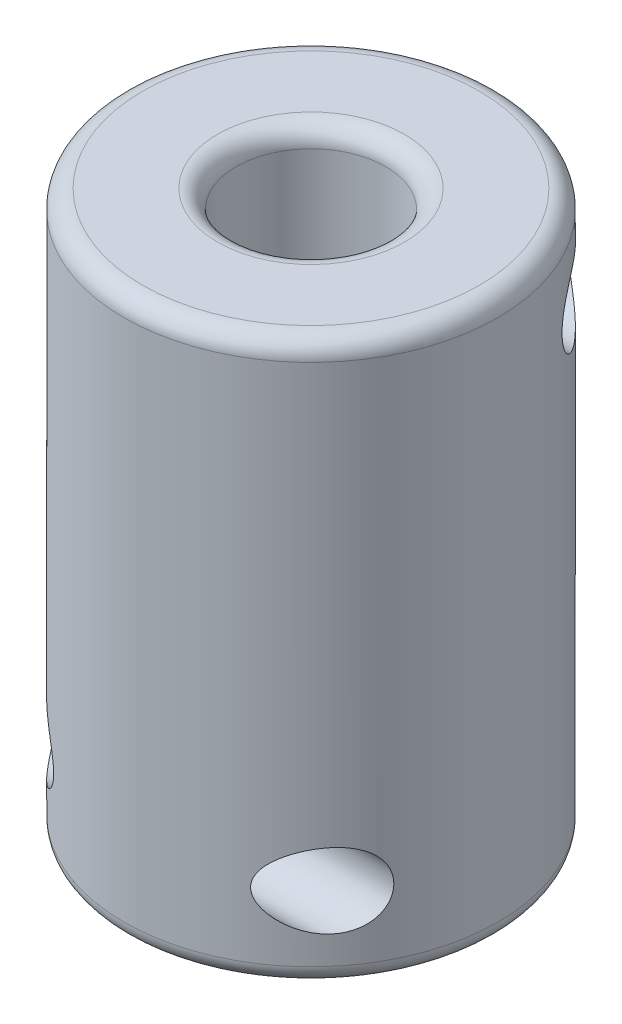
ISO-10303-21;
HEADER;
FILE_DESCRIPTION(('STEP AP214'),'2;1');
FILE_NAME('part.step','',(''),(''),'','','');
FILE_SCHEMA(('AUTOMOTIVE_DESIGN { 1 0 10303 214 1 1 1 1 }'));
ENDSEC;
DATA;
#1=APPLICATION_CONTEXT('core data for automotive mechanical design processes');
#2=APPLICATION_PROTOCOL_DEFINITION('international standard','automotive_design',2000,#1);
#3=PRODUCT_CONTEXT('',#1,'mechanical');
#4=PRODUCT('Part','Part','',(#3));
#5=PRODUCT_RELATED_PRODUCT_CATEGORY('part','',(#4));
#6=PRODUCT_DEFINITION_FORMATION('','',#4);
#7=PRODUCT_DEFINITION_CONTEXT('part definition',#1,'design');
#8=PRODUCT_DEFINITION('design','',#6,#7);
#9=PRODUCT_DEFINITION_SHAPE('','',#8);
#10=(LENGTH_UNIT() NAMED_UNIT(*) SI_UNIT(.MILLI.,.METRE.));
#11=(NAMED_UNIT(*) PLANE_ANGLE_UNIT() SI_UNIT($,.RADIAN.));
#12=(NAMED_UNIT(*) SI_UNIT($,.STERADIAN.) SOLID_ANGLE_UNIT());
#13=UNCERTAINTY_MEASURE_WITH_UNIT(LENGTH_MEASURE(1.E-05),#10,'distance_accuracy_value','');
#14=(GEOMETRIC_REPRESENTATION_CONTEXT(3) GLOBAL_UNCERTAINTY_ASSIGNED_CONTEXT((#13)) GLOBAL_UNIT_ASSIGNED_CONTEXT((#10,
#11,#12)) REPRESENTATION_CONTEXT('',''));
#15=CARTESIAN_POINT('',(0.,0.,0.));
#16=DIRECTION('',(0.,0.,1.));
#17=DIRECTION('',(1.,0.,0.));
#18=AXIS2_PLACEMENT_3D('',#15,#16,#17);
#19=CARTESIAN_POINT('',(0.,30.,0.));
#20=DIRECTION('',(0.,1.,0.));
#21=DIRECTION('',(0.,0.,1.));
#22=AXIS2_PLACEMENT_3D('',#19,#20,#21);
#23=PLANE('',#22);
#24=CARTESIAN_POINT('',(0.,30.,0.));
#25=DIRECTION('',(0.,1.,0.));
#26=DIRECTION('',(0.,0.,1.));
#27=AXIS2_PLACEMENT_3D('',#24,#25,#26);
#28=CIRCLE('',#27,5.);
#29=CARTESIAN_POINT('',(0.,30.,5.));
#30=VERTEX_POINT('',#29);
#31=EDGE_CURVE('E10',#30,#30,#28,.F.);
#32=ORIENTED_EDGE('',*,*,#31,.T.);
#33=EDGE_LOOP('',(#32));
#34=FACE_BOUND('',#33,.T.);
#35=CARTESIAN_POINT('',(0.,30.,0.));
#36=DIRECTION('',(0.,1.,0.));
#37=DIRECTION('',(0.,0.,1.));
#38=AXIS2_PLACEMENT_3D('',#35,#36,#37);
#39=CIRCLE('',#38,9.);
#40=CARTESIAN_POINT('',(0.,30.,9.));
#41=VERTEX_POINT('',#40);
#42=EDGE_CURVE('E44',#41,#41,#39,.T.);
#43=ORIENTED_EDGE('',*,*,#42,.T.);
#44=EDGE_LOOP('',(#43));
#45=FACE_BOUND('',#44,.T.);
#46=ADVANCED_FACE('F37',(#34,#45),#23,.T.);
#47=CARTESIAN_POINT('',(0.,0.,0.));
#48=DIRECTION('',(0.,1.,0.));
#49=DIRECTION('',(0.,0.,1.));
#50=AXIS2_PLACEMENT_3D('',#47,#48,#49);
#51=PLANE('',#50);
#52=CARTESIAN_POINT('',(0.,0.,0.));
#53=DIRECTION('',(0.,1.,0.));
#54=DIRECTION('',(0.,0.,1.));
#55=AXIS2_PLACEMENT_3D('',#52,#53,#54);
#56=CIRCLE('',#55,5.);
#57=CARTESIAN_POINT('',(0.,0.,5.));
#58=VERTEX_POINT('',#57);
#59=EDGE_CURVE('E63',#58,#58,#56,.T.);
#60=ORIENTED_EDGE('',*,*,#59,.T.);
#61=EDGE_LOOP('',(#60));
#62=FACE_BOUND('',#61,.T.);
#63=CARTESIAN_POINT('',(0.,0.,0.));
#64=DIRECTION('',(0.,1.,0.));
#65=DIRECTION('',(0.,0.,1.));
#66=AXIS2_PLACEMENT_3D('',#63,#64,#65);
#67=CIRCLE('',#66,9.);
#68=CARTESIAN_POINT('',(0.,0.,9.));
#69=VERTEX_POINT('',#68);
#70=EDGE_CURVE('E66',#69,#69,#67,.F.);
#71=ORIENTED_EDGE('',*,*,#70,.T.);
#72=EDGE_LOOP('',(#71));
#73=FACE_BOUND('',#72,.T.);
#74=ADVANCED_FACE('F119',(#62,#73),#51,.F.);
#75=CARTESIAN_POINT('',(0.,30.,0.));
#76=DIRECTION('',(0.,-1.,0.));
#77=DIRECTION('',(0.,0.,-1.));
#78=AXIS2_PLACEMENT_3D('',#75,#76,#77);
#79=CYLINDRICAL_SURFACE('',#78,10.);
#80=CARTESIAN_POINT('',(0.,1.,0.));
#81=DIRECTION('',(0.,1.,0.));
#82=DIRECTION('',(0.,0.,1.));
#83=AXIS2_PLACEMENT_3D('',#80,#81,#82);
#84=CIRCLE('',#83,10.);
#85=CARTESIAN_POINT('',(0.,1.,10.));
#86=VERTEX_POINT('',#85);
#87=EDGE_CURVE('E48',#86,#86,#84,.T.);
#88=ORIENTED_EDGE('',*,*,#87,.T.);
#89=EDGE_LOOP('',(#88));
#90=FACE_BOUND('',#89,.T.);
#91=CARTESIAN_POINT('',(0.,29.,0.));
#92=DIRECTION('',(0.,1.,0.));
#93=DIRECTION('',(0.,0.,1.));
#94=AXIS2_PLACEMENT_3D('',#91,#92,#93);
#95=CIRCLE('',#94,10.);
#96=CARTESIAN_POINT('',(0.,29.,10.));
#97=VERTEX_POINT('',#96);
#98=EDGE_CURVE('E52',#97,#97,#95,.F.);
#99=ORIENTED_EDGE('',*,*,#98,.T.);
#100=EDGE_LOOP('',(#99));
#101=FACE_BOUND('',#100,.T.);
#102=CARTESIAN_POINT('',(-5.26782687642637,25.5,-8.5));
#103=CARTESIAN_POINT('',(-5.26783468933703,25.5641810144466,-8.49999585800703));
#104=CARTESIAN_POINT('',(-5.27287446632023,25.6284018901688,-8.49687808090354));
#105=CARTESIAN_POINT('',(-5.29241116775197,25.7548229722007,-8.48472194501432));
#106=CARTESIAN_POINT('',(-5.30692237379403,25.8170199778692,-8.47567464525058));
#107=CARTESIAN_POINT('',(-5.34877974231708,25.9540486137529,-8.44933764641172));
#108=CARTESIAN_POINT('',(-5.37851325511278,26.0278402155853,-8.43049561530521));
#109=CARTESIAN_POINT('',(-5.44717856580428,26.1688723060571,-8.38629351416825));
#110=CARTESIAN_POINT('',(-5.48613060979344,26.2360979084608,-8.36091908651258));
#111=CARTESIAN_POINT('',(-5.59565474938343,26.4026008048988,-8.2882521680363));
#112=CARTESIAN_POINT('',(-5.67115545397736,26.4968414981962,-8.23695530960263));
#113=CARTESIAN_POINT('',(-5.83090508601502,26.6709943185028,-8.12466452975615));
#114=CARTESIAN_POINT('',(-5.91517636445182,26.7508683484064,-8.06364561182168));
#115=CARTESIAN_POINT('',(-6.06993090860967,26.8822431285574,-7.94752932180928));
#116=CARTESIAN_POINT('',(-6.13952500792072,26.9361628889242,-7.89394148714846));
#117=CARTESIAN_POINT('',(-6.28045077932381,27.0366792751538,-7.78228897329592));
#118=CARTESIAN_POINT('',(-6.35178334114708,27.0832720561948,-7.72422196732808));
#119=CARTESIAN_POINT('',(-6.49531393900922,27.1693778463069,-7.60392506638708));
#120=CARTESIAN_POINT('',(-6.56751264158712,27.208884972578,-7.54169177071286));
#121=CARTESIAN_POINT('',(-6.71202828732485,27.280777462762,-7.41336733040518));
#122=CARTESIAN_POINT('',(-6.78434523258653,27.3131626986606,-7.34727611645364));
#123=CARTESIAN_POINT('',(-6.93013465473774,27.3712676016843,-7.20995735537162));
#124=CARTESIAN_POINT('',(-7.00359639591283,27.3968204166321,-7.13864757142014));
#125=CARTESIAN_POINT('',(-7.14945658663805,27.4398922804075,-6.9925622590824));
#126=CARTESIAN_POINT('',(-7.22185486995423,27.4574100859137,-6.91778619630077));
#127=CARTESIAN_POINT('',(-7.36488245400177,27.4838309586506,-6.76530900556368));
#128=CARTESIAN_POINT('',(-7.43551463905561,27.4927491063008,-6.68761324718972));
#129=CARTESIAN_POINT('',(-7.57450422890797,27.5013393572645,-6.52977430005425));
#130=CARTESIAN_POINT('',(-7.6428625681056,27.5010153066976,-6.44963214322526));
#131=CARTESIAN_POINT('',(-7.80577298479456,27.4880265391663,-6.25240275225441));
#132=CARTESIAN_POINT('',(-7.89883476339544,27.4700733198581,-6.13435956549366));
#133=CARTESIAN_POINT('',(-8.07686513309303,27.4111144767495,-5.89797241753845));
#134=CARTESIAN_POINT('',(-8.1618442260271,27.3701392574216,-5.77962905756117));
#135=CARTESIAN_POINT('',(-8.30818802006161,27.2720768516786,-5.56667309385873));
#136=CARTESIAN_POINT('',(-8.3711278593854,27.2188135940561,-5.47139289105609));
#137=CARTESIAN_POINT('',(-8.48852288877,27.0943579580769,-5.28742566198973));
#138=CARTESIAN_POINT('',(-8.54298000161333,27.0231696523972,-5.19873714397661));
#139=CARTESIAN_POINT('',(-8.64249124894106,26.8628152312219,-5.03158927374364));
#140=CARTESIAN_POINT('',(-8.68747978644655,26.77353160396,-4.95320260994332));
#141=CARTESIAN_POINT('',(-8.76653895619213,26.5792197951433,-4.81190003614039));
#142=CARTESIAN_POINT('',(-8.80061627516256,26.4742013145459,-4.74897465650912));
#143=CARTESIAN_POINT('',(-8.85372236687568,26.2655036757026,-4.6491302811934));
#144=CARTESIAN_POINT('',(-8.87408136340246,26.1632296651462,-4.60997270289893));
#145=CARTESIAN_POINT('',(-8.90562480807577,25.9523529397072,-4.54874164366921));
#146=CARTESIAN_POINT('',(-8.91681392734973,25.8437534772402,-4.52665946486451));
#147=CARTESIAN_POINT('',(-8.9294150394175,25.6321753106102,-4.50174647314831));
#148=CARTESIAN_POINT('',(-8.93150063825177,25.5293902366901,-4.49758960341635));
#149=CARTESIAN_POINT('',(-8.92772613995887,25.3245568048789,-4.50507771888106));
#150=CARTESIAN_POINT('',(-8.92186771586574,25.222508296415,-4.51671937686283));
#151=CARTESIAN_POINT('',(-8.90244223664521,25.0240342779298,-4.55488330792238));
#152=CARTESIAN_POINT('',(-8.88902317418737,24.9275389000015,-4.58111977921979));
#153=CARTESIAN_POINT('',(-8.85471376785878,24.7407045569377,-4.6470869456755));
#154=CARTESIAN_POINT('',(-8.83382325725241,24.6503657292478,-4.68681794198162));
#155=CARTESIAN_POINT('',(-8.78421833092708,24.4759624441933,-4.77915329612052));
#156=CARTESIAN_POINT('',(-8.75532959100645,24.3920984086052,-4.83204145188658));
#157=CARTESIAN_POINT('',(-8.69035848562896,24.2348323507535,-4.94793643896143));
#158=CARTESIAN_POINT('',(-8.65427451463974,24.1614326697696,-5.01094552802778));
#159=CARTESIAN_POINT('',(-8.57268661322164,24.0214433399385,-5.14936142321092));
#160=CARTESIAN_POINT('',(-8.52669998802749,23.9556904785029,-5.22532741425819));
#161=CARTESIAN_POINT('',(-8.42792094588793,23.8379325519282,-5.38319882641644));
#162=CARTESIAN_POINT('',(-8.37512621162925,23.7859321862727,-5.46510626567847));
#163=CARTESIAN_POINT('',(-8.25656515294015,23.6898138395964,-5.64286368641929));
#164=CARTESIAN_POINT('',(-8.19000272653328,23.6475234283882,-5.73916723545717));
#165=CARTESIAN_POINT('',(-8.05067224057732,23.5792852616135,-5.93304235441428));
#166=CARTESIAN_POINT('',(-7.9778991235997,23.5533509719819,-6.03061490182587));
#167=CARTESIAN_POINT('',(-7.79273251095244,23.5081116864283,-6.26939630113612));
#168=CARTESIAN_POINT('',(-7.67750397904637,23.4973344256426,-6.41004577287917));
#169=CARTESIAN_POINT('',(-7.43985242696654,23.503781633376,-6.68443916519708));
#170=CARTESIAN_POINT('',(-7.31741865255885,23.5210490369932,-6.81817217344082));
#171=CARTESIAN_POINT('',(-7.06671259124475,23.580577050101,-7.07775439645018));
#172=CARTESIAN_POINT('',(-6.93838204166168,23.6231895315093,-7.20346448074513));
#173=CARTESIAN_POINT('',(-6.68044568802202,23.7315139312166,-7.4432939062457));
#174=CARTESIAN_POINT('',(-6.55083927269147,23.7972375038227,-7.55740736208781));
#175=CARTESIAN_POINT('',(-6.36347883433235,23.9097462582046,-7.71441049361888));
#176=CARTESIAN_POINT('',(-6.3046434650718,23.9476499680435,-7.76254223330248));
#177=CARTESIAN_POINT('',(-6.1880290252326,24.0284127341426,-7.85581664537213));
#178=CARTESIAN_POINT('',(-6.13024954078748,24.0712697984418,-7.90096050790793));
#179=CARTESIAN_POINT('',(-6.01645344389805,24.1621126744182,-7.98795407462859));
#180=CARTESIAN_POINT('',(-5.9604341469093,24.2100901307783,-8.02980895758489));
#181=CARTESIAN_POINT('',(-5.85095670080282,24.3115910719135,-8.10992605430749));
#182=CARTESIAN_POINT('',(-5.79749686351125,24.3651108252883,-8.14819065260638));
#183=CARTESIAN_POINT('',(-5.69013439778527,24.4828434624383,-8.22356407639358));
#184=CARTESIAN_POINT('',(-5.63654712188264,24.5475714618167,-8.26032781088111));
#185=CARTESIAN_POINT('',(-5.53609981701022,24.6849314015301,-8.32798013172293));
#186=CARTESIAN_POINT('',(-5.48923359071316,24.7575559505502,-8.35887413907183));
#187=CARTESIAN_POINT('',(-5.41446144564242,24.8951835866438,-8.40744734385509));
#188=CARTESIAN_POINT('',(-5.38463943993381,24.9586283750081,-8.42653864791776));
#189=CARTESIAN_POINT('',(-5.33386960184705,25.0903741222918,-8.45876750482235));
#190=CARTESIAN_POINT('',(-5.31289940473602,25.1586623272838,-8.47192006825766));
#191=CARTESIAN_POINT('',(-5.28784078417205,25.2729250329884,-8.48757147169723));
#192=CARTESIAN_POINT('',(-5.28038061026528,25.3178798224046,-8.49220912164965));
#193=CARTESIAN_POINT('',(-5.27037095442739,25.4085496776573,-8.49842481064375));
#194=CARTESIAN_POINT('',(-5.26782130895951,25.4542647181237,-8.50000295157715));
#195=CARTESIAN_POINT('',(-5.26782687642637,25.5,-8.5));
#196=B_SPLINE_CURVE_WITH_KNOTS('',3,(#102,#103,#104,#105,#106,#107,#108,#109,#110,#111,#112,
#113,#114,#115,#116,#117,#118,#119,#120,#121,#122,#123,#124,#125,#126,#127,#128,#129,#130,#131,
#132,#133,#134,#135,#136,#137,#138,#139,#140,#141,#142,#143,#144,#145,#146,#147,#148,#149,#150,
#151,#152,#153,#154,#155,#156,#157,#158,#159,#160,#161,#162,#163,#164,#165,#166,#167,#168,#169,
#170,#171,#172,#173,#174,#175,#176,#177,#178,#179,#180,#181,#182,#183,#184,#185,#186,#187,#188,
#189,#190,#191,#192,#193,#194,#195),.UNSPECIFIED.,.T.,.F.,(4,2,2,2,2,2,2,2,2,2,2,2,2,2,2,2,2,2,
2,2,2,2,2,2,2,2,2,2,2,2,2,2,2,2,2,2,2,2,2,2,2,2,2,2,2,2,4),(0.,0.192356136850875,
0.385002992074888,0.628894166773206,0.873326038472196,1.2647502249882,1.6571975490887,
1.96600552620744,2.27497501298995,2.58419984322563,2.89343023124566,3.20963664233791,
3.52589196609085,3.84159168830622,4.15716003472642,4.60951992656819,5.06128379966637,
5.43774761785874,5.81412597830308,6.19303173582779,6.57170484183424,6.90409493143276,
7.2363155963824,7.54348589355933,7.8505915098358,8.15188481929897,8.4531848529548,
8.76165355457469,9.07019116458734,9.40033411224758,9.73058973054751,10.1025963905346,
10.4749089237944,11.0183699690919,11.5626638129415,12.1146966298919,12.6670082224276,
12.9216750850292,13.176239888935,13.4303954745694,13.6843810466807,13.9589539285194,
14.2332719822563,14.4505132535807,14.6672023153504,14.8042795369341,14.9413521933162),.UNSPECIFIED.);
#197=CARTESIAN_POINT('',(-5.26782687642637,25.5,-8.5));
#198=VERTEX_POINT('',#197);
#199=EDGE_CURVE('E69',#198,#198,#196,.T.);
#200=ORIENTED_EDGE('',*,*,#199,.T.);
#201=EDGE_LOOP('',(#200));
#202=FACE_BOUND('',#201,.T.);
#203=CARTESIAN_POINT('',(5.26782687642637,25.5,-8.5));
#204=CARTESIAN_POINT('',(5.26783468933703,25.4358189855534,-8.49999585800703));
#205=CARTESIAN_POINT('',(5.27287446632023,25.3715981098312,-8.49687808090354));
#206=CARTESIAN_POINT('',(5.29241116775197,25.2451770277993,-8.48472194501432));
#207=CARTESIAN_POINT('',(5.30692237379403,25.1829800221308,-8.47567464525058));
#208=CARTESIAN_POINT('',(5.34877974231708,25.0459513862471,-8.44933764641172));
#209=CARTESIAN_POINT('',(5.37851325511278,24.9721597844147,-8.4304956153052));
#210=CARTESIAN_POINT('',(5.44717856580428,24.8311276939429,-8.38629351416825));
#211=CARTESIAN_POINT('',(5.48613060979344,24.7639020915392,-8.36091908651258));
#212=CARTESIAN_POINT('',(5.59565474938343,24.5973991951012,-8.2882521680363));
#213=CARTESIAN_POINT('',(5.67115545397735,24.5031585018038,-8.23695530960263));
#214=CARTESIAN_POINT('',(5.83090508601502,24.3290056814972,-8.12466452975615));
#215=CARTESIAN_POINT('',(5.91517636445182,24.2491316515936,-8.06364561182168));
#216=CARTESIAN_POINT('',(6.06993090860967,24.1177568714426,-7.94752932180928));
#217=CARTESIAN_POINT('',(6.13952500792072,24.0638371110758,-7.89394148714846));
#218=CARTESIAN_POINT('',(6.28045077932381,23.9633207248462,-7.78228897329592));
#219=CARTESIAN_POINT('',(6.35178334114708,23.9167279438052,-7.72422196732808));
#220=CARTESIAN_POINT('',(6.49531393900922,23.8306221536931,-7.60392506638708));
#221=CARTESIAN_POINT('',(6.56751264158712,23.791115027422,-7.54169177071286));
#222=CARTESIAN_POINT('',(6.71202828732485,23.719222537238,-7.41336733040518));
#223=CARTESIAN_POINT('',(6.78434523258653,23.6868373013394,-7.34727611645364));
#224=CARTESIAN_POINT('',(6.93013465473774,23.6287323983157,-7.20995735537162));
#225=CARTESIAN_POINT('',(7.00359639591283,23.6031795833679,-7.13864757142014));
#226=CARTESIAN_POINT('',(7.14945658663805,23.5601077195924,-6.9925622590824));
#227=CARTESIAN_POINT('',(7.22185486995423,23.5425899140863,-6.91778619630077));
#228=CARTESIAN_POINT('',(7.36488245400177,23.5161690413494,-6.76530900556368));
#229=CARTESIAN_POINT('',(7.43551463905561,23.5072508936992,-6.68761324718972));
#230=CARTESIAN_POINT('',(7.57450422890797,23.4986606427355,-6.52977430005425));
#231=CARTESIAN_POINT('',(7.6428625681056,23.4989846933024,-6.44963214322526));
#232=CARTESIAN_POINT('',(7.80577298479456,23.5119734608337,-6.25240275225441));
#233=CARTESIAN_POINT('',(7.89883476339544,23.5299266801419,-6.13435956549367));
#234=CARTESIAN_POINT('',(8.07686513309303,23.5888855232505,-5.89797241753845));
#235=CARTESIAN_POINT('',(8.1618442260271,23.6298607425784,-5.77962905756117));
#236=CARTESIAN_POINT('',(8.30818802006161,23.7279231483214,-5.56667309385873));
#237=CARTESIAN_POINT('',(8.3711278593854,23.7811864059439,-5.47139289105609));
#238=CARTESIAN_POINT('',(8.48852288877,23.9056420419231,-5.28742566198973));
#239=CARTESIAN_POINT('',(8.54298000161333,23.9768303476028,-5.19873714397661));
#240=CARTESIAN_POINT('',(8.64249124894106,24.1371847687781,-5.03158927374364));
#241=CARTESIAN_POINT('',(8.68747978644655,24.22646839604,-4.95320260994332));
#242=CARTESIAN_POINT('',(8.76653895619213,24.4207802048567,-4.81190003614039));
#243=CARTESIAN_POINT('',(8.80061627516256,24.5257986854541,-4.74897465650912));
#244=CARTESIAN_POINT('',(8.85372236687568,24.7344963242974,-4.6491302811934));
#245=CARTESIAN_POINT('',(8.87408136340246,24.8367703348538,-4.60997270289893));
#246=CARTESIAN_POINT('',(8.90562480807577,25.0476470602928,-4.54874164366921));
#247=CARTESIAN_POINT('',(8.91681392734973,25.1562465227598,-4.52665946486451));
#248=CARTESIAN_POINT('',(8.9294150394175,25.3678246893898,-4.50174647314831));
#249=CARTESIAN_POINT('',(8.93150063825177,25.4706097633099,-4.49758960341635));
#250=CARTESIAN_POINT('',(8.92772613995887,25.6754431951211,-4.50507771888106));
#251=CARTESIAN_POINT('',(8.92186771586574,25.777491703585,-4.51671937686283));
#252=CARTESIAN_POINT('',(8.90244223664521,25.9759657220702,-4.55488330792238));
#253=CARTESIAN_POINT('',(8.88902317418737,26.0724610999985,-4.58111977921979));
#254=CARTESIAN_POINT('',(8.85471376785878,26.2592954430623,-4.6470869456755));
#255=CARTESIAN_POINT('',(8.83382325725241,26.3496342707522,-4.68681794198162));
#256=CARTESIAN_POINT('',(8.78421833092708,26.5240375558067,-4.77915329612052));
#257=CARTESIAN_POINT('',(8.75532959100645,26.6079015913948,-4.83204145188658));
#258=CARTESIAN_POINT('',(8.69035848562896,26.7651676492465,-4.94793643896143));
#259=CARTESIAN_POINT('',(8.65427451463974,26.8385673302304,-5.01094552802778));
#260=CARTESIAN_POINT('',(8.57268661322164,26.9785566600615,-5.14936142321092));
#261=CARTESIAN_POINT('',(8.52669998802749,27.0443095214971,-5.22532741425819));
#262=CARTESIAN_POINT('',(8.42792094588793,27.1620674480718,-5.38319882641644));
#263=CARTESIAN_POINT('',(8.37512621162925,27.2140678137273,-5.46510626567847));
#264=CARTESIAN_POINT('',(8.25656515294015,27.3101861604036,-5.64286368641929));
#265=CARTESIAN_POINT('',(8.19000272653328,27.3524765716118,-5.73916723545717));
#266=CARTESIAN_POINT('',(8.05067224057732,27.4207147383865,-5.93304235441428));
#267=CARTESIAN_POINT('',(7.9778991235997,27.4466490280181,-6.03061490182587));
#268=CARTESIAN_POINT('',(7.79273251095244,27.4918883135717,-6.26939630113612));
#269=CARTESIAN_POINT('',(7.67750397904637,27.5026655743574,-6.41004577287917));
#270=CARTESIAN_POINT('',(7.43985242696654,27.496218366624,-6.68443916519708));
#271=CARTESIAN_POINT('',(7.31741865255885,27.4789509630068,-6.81817217344082));
#272=CARTESIAN_POINT('',(7.06671259124475,27.419422949899,-7.07775439645018));
#273=CARTESIAN_POINT('',(6.93838204166168,27.3768104684907,-7.20346448074513));
#274=CARTESIAN_POINT('',(6.68044568802202,27.2684860687834,-7.4432939062457));
#275=CARTESIAN_POINT('',(6.55083927269147,27.2027624961773,-7.55740736208781));
#276=CARTESIAN_POINT('',(6.36347883433235,27.0902537417954,-7.71441049361888));
#277=CARTESIAN_POINT('',(6.3046434650718,27.0523500319565,-7.76254223330248));
#278=CARTESIAN_POINT('',(6.1880290252326,26.9715872658574,-7.85581664537213));
#279=CARTESIAN_POINT('',(6.13024954078748,26.9287302015582,-7.90096050790793));
#280=CARTESIAN_POINT('',(6.01645344389805,26.8378873255818,-7.98795407462859));
#281=CARTESIAN_POINT('',(5.9604341469093,26.7899098692217,-8.02980895758489));
#282=CARTESIAN_POINT('',(5.85095670080282,26.6884089280865,-8.10992605430749));
#283=CARTESIAN_POINT('',(5.79749686351125,26.6348891747117,-8.14819065260638));
#284=CARTESIAN_POINT('',(5.69013439778527,26.5171565375617,-8.22356407639358));
#285=CARTESIAN_POINT('',(5.63654712188264,26.4524285381833,-8.26032781088111));
#286=CARTESIAN_POINT('',(5.53609981701022,26.3150685984699,-8.32798013172294));
#287=CARTESIAN_POINT('',(5.48923359071316,26.2424440494498,-8.35887413907183));
#288=CARTESIAN_POINT('',(5.41446144564242,26.1048164133562,-8.40744734385509));
#289=CARTESIAN_POINT('',(5.38463943993381,26.0413716249919,-8.42653864791776));
#290=CARTESIAN_POINT('',(5.33386960184705,25.9096258777082,-8.45876750482235));
#291=CARTESIAN_POINT('',(5.31289940473602,25.8413376727162,-8.47192006825766));
#292=CARTESIAN_POINT('',(5.28784078417205,25.7270749670116,-8.48757147169723));
#293=CARTESIAN_POINT('',(5.28038061026528,25.6821201775954,-8.49220912164965));
#294=CARTESIAN_POINT('',(5.27037095442739,25.5914503223427,-8.49842481064375));
#295=CARTESIAN_POINT('',(5.26782130895951,25.5457352818763,-8.50000295157715));
#296=CARTESIAN_POINT('',(5.26782687642637,25.5,-8.5));
#297=B_SPLINE_CURVE_WITH_KNOTS('',3,(#203,#204,#205,#206,#207,#208,#209,#210,#211,#212,#213,
#214,#215,#216,#217,#218,#219,#220,#221,#222,#223,#224,#225,#226,#227,#228,#229,#230,#231,#232,
#233,#234,#235,#236,#237,#238,#239,#240,#241,#242,#243,#244,#245,#246,#247,#248,#249,#250,#251,
#252,#253,#254,#255,#256,#257,#258,#259,#260,#261,#262,#263,#264,#265,#266,#267,#268,#269,#270,
#271,#272,#273,#274,#275,#276,#277,#278,#279,#280,#281,#282,#283,#284,#285,#286,#287,#288,#289,
#290,#291,#292,#293,#294,#295,#296),.UNSPECIFIED.,.T.,.F.,(4,2,2,2,2,2,2,2,2,2,2,2,2,2,2,2,2,2,
2,2,2,2,2,2,2,2,2,2,2,2,2,2,2,2,2,2,2,2,2,2,2,2,2,2,2,2,4),(0.,0.192356136850875,
0.385002992074888,0.628894166773214,0.873326038472196,1.2647502249882,1.6571975490887,
1.96600552620744,2.27497501298995,2.58419984322563,2.89343023124567,3.20963664233791,
3.52589196609085,3.84159168830622,4.15716003472643,4.60951992656819,5.06128379966637,
5.43774761785874,5.81412597830308,6.19303173582779,6.57170484183424,6.90409493143276,
7.2363155963824,7.54348589355933,7.8505915098358,8.15188481929897,8.4531848529548,
8.76165355457469,9.07019116458734,9.40033411224758,9.73058973054751,10.1025963905346,
10.4749089237944,11.0183699690919,11.5626638129415,12.1146966298919,12.6670082224276,
12.9216750850292,13.176239888935,13.4303954745694,13.6843810466807,13.9589539285194,
14.2332719822563,14.4505132535808,14.6672023153504,14.8042795369341,14.9413521933162),.UNSPECIFIED.);
#298=CARTESIAN_POINT('',(5.26782687642637,25.5,-8.5));
#299=VERTEX_POINT('',#298);
#300=EDGE_CURVE('E77',#299,#299,#297,.T.);
#301=ORIENTED_EDGE('',*,*,#300,.T.);
#302=EDGE_LOOP('',(#301));
#303=FACE_BOUND('',#302,.T.);
#304=CARTESIAN_POINT('',(-8.93028554974588,4.5,4.5));
#305=CARTESIAN_POINT('',(-8.93028695994491,4.60251908318556,4.49999424650266));
#306=CARTESIAN_POINT('',(-8.9263126480724,4.70500244851639,4.50790957581226));
#307=CARTESIAN_POINT('',(-8.91045495734808,4.90692224123514,4.53917400928241));
#308=CARTESIAN_POINT('',(-8.89857493789984,5.00635994406268,4.56251655786487));
#309=CARTESIAN_POINT('',(-8.86703729509127,5.19928547846273,4.62350663067364));
#310=CARTESIAN_POINT('',(-8.84738898578792,5.29278028022131,4.66113702186731));
#311=CARTESIAN_POINT('',(-8.80053397958957,5.47157109812932,4.74900724079461));
#312=CARTESIAN_POINT('',(-8.77332630609691,5.55686605301915,4.79924869767643));
#313=CARTESIAN_POINT('',(-8.71086367461473,5.71961030171675,4.91172977553368));
#314=CARTESIAN_POINT('',(-8.67540879948888,5.79678087860329,4.97426021255354));
#315=CARTESIAN_POINT('',(-8.59744484378922,5.93923773233773,5.10782920507559));
#316=CARTESIAN_POINT('',(-8.55493395222354,6.00452094914079,5.17886994351944));
#317=CARTESIAN_POINT('',(-8.45932683832755,6.12804536424431,5.33374106336925));
#318=CARTESIAN_POINT('',(-8.40561652619928,6.18508578408844,5.41814679783292));
#319=CARTESIAN_POINT('',(-8.29160021843436,6.28432339771251,5.59107447354278));
#320=CARTESIAN_POINT('',(-8.2312913436627,6.32651407801202,5.67959820182174));
#321=CARTESIAN_POINT('',(-8.09558483180366,6.40196863761346,5.87173838542017));
#322=CARTESIAN_POINT('',(-8.01928327256835,6.43292690667104,5.975617734749));
#323=CARTESIAN_POINT('',(-7.86082768374191,6.4774937896971,6.18259250029893));
#324=CARTESIAN_POINT('',(-7.77866925504798,6.4910892143082,6.2856872615022));
#325=CARTESIAN_POINT('',(-7.56918742967299,6.50532522718103,6.5380116497424));
#326=CARTESIAN_POINT('',(-7.43916534433482,6.4965757238822,6.68555279133046));
#327=CARTESIAN_POINT('',(-7.17305384603504,6.44928566285169,6.97032692945614));
#328=CARTESIAN_POINT('',(-7.03695159373923,6.41067895428584,7.1075362934657));
#329=CARTESIAN_POINT('',(-6.83038800415784,6.3324627087157,7.30445550541691));
#330=CARTESIAN_POINT('',(-6.76063754100397,6.3027265159099,7.36903048209584));
#331=CARTESIAN_POINT('',(-6.62111815610134,6.23658741231943,7.49463711626133));
#332=CARTESIAN_POINT('',(-6.55134924656561,6.20018654800023,7.55566985387817));
#333=CARTESIAN_POINT('',(-6.41245823287937,6.12081228428604,7.673896641618));
#334=CARTESIAN_POINT('',(-6.34333549341237,6.07784627026805,7.73109490253611));
#335=CARTESIAN_POINT('',(-6.2064256735377,5.98517866816432,7.84142880614206));
#336=CARTESIAN_POINT('',(-6.13863801073122,5.93548009505464,7.89456625077962));
#337=CARTESIAN_POINT('',(-5.99044782520503,5.81706049188389,8.00781157817205));
#338=CARTESIAN_POINT('',(-5.9106072356108,5.74656963592954,8.06682756671953));
#339=CARTESIAN_POINT('',(-5.75707421700095,5.59371423156617,8.17710082583848));
#340=CARTESIAN_POINT('',(-5.68337518143883,5.51136270905108,8.22836648318081));
#341=CARTESIAN_POINT('',(-5.5660589303607,5.35814529147661,8.30797985110127));
#342=CARTESIAN_POINT('',(-5.51981135574558,5.29056455726921,8.33871780957168));
#343=CARTESIAN_POINT('',(-5.43582584410533,5.14784116419552,8.39370621140374));
#344=CARTESIAN_POINT('',(-5.39807174142544,5.07271327113663,8.41796899567609));
#345=CARTESIAN_POINT('',(-5.34311346383607,4.9355677422052,8.45292382139561));
#346=CARTESIAN_POINT('',(-5.32312055742142,4.87516642054125,8.46550200225049));
#347=CARTESIAN_POINT('',(-5.29176904143191,4.75130122408331,8.4851357092215));
#348=CARTESIAN_POINT('',(-5.28039906516154,4.68784149870194,8.49219850605027));
#349=CARTESIAN_POINT('',(-5.26755899307402,4.55913081516998,8.50016980698475));
#350=CARTESIAN_POINT('',(-5.26614727305669,4.49387154249448,8.50104202177033));
#351=CARTESIAN_POINT('',(-5.27357202176654,4.36415730080561,8.49643770856285));
#352=CARTESIAN_POINT('',(-5.28241326588697,4.29970272072114,8.49095822221891));
#353=CARTESIAN_POINT('',(-5.3082279457571,4.17831797431762,8.4748403695264));
#354=CARTESIAN_POINT('',(-5.3245425462651,4.12118585059345,8.4646192283882));
#355=CARTESIAN_POINT('',(-5.36360016642667,4.01017341204862,8.43992469792515));
#356=CARTESIAN_POINT('',(-5.38634556607098,3.95629431012291,8.425449734214));
#357=CARTESIAN_POINT('',(-5.45496177353184,3.81477441375584,8.38128970089334));
#358=CARTESIAN_POINT('',(-5.50572557210055,3.73060114112558,8.34813734716695));
#359=CARTESIAN_POINT('',(-5.61652223422507,3.57231672280687,8.27400463066948));
#360=CARTESIAN_POINT('',(-5.67658848325122,3.49824370095628,8.2329959415245));
#361=CARTESIAN_POINT('',(-5.79203691020225,3.37069189715088,8.1520821637093));
#362=CARTESIAN_POINT('',(-5.84656552889984,3.31582946742105,8.1131041545233));
#363=CARTESIAN_POINT('',(-5.95831558573092,3.21189649447776,8.0313927988758));
#364=CARTESIAN_POINT('',(-6.01553879368122,3.16282983430597,7.98865696782099));
#365=CARTESIAN_POINT('',(-6.13174938984073,3.07008555079069,7.89981022658346));
#366=CARTESIAN_POINT('',(-6.1907376345083,3.02641059815966,7.8536976616528));
#367=CARTESIAN_POINT('',(-6.30980026064209,2.94421323093491,7.75836665877951));
#368=CARTESIAN_POINT('',(-6.36987507096831,2.90569290353922,7.70914697451076));
#369=CARTESIAN_POINT('',(-6.55826958909585,2.79327388436341,7.5509574525888));
#370=CARTESIAN_POINT('',(-6.68761787161234,2.7281080614511,7.4368450666677));
#371=CARTESIAN_POINT('',(-6.9449869446905,2.62083006045075,7.19709103696667));
#372=CARTESIAN_POINT('',(-7.07300838447063,2.57870602958908,7.07145535971792));
#373=CARTESIAN_POINT('',(-7.32220885509861,2.52029794548512,6.81298685933177));
#374=CARTESIAN_POINT('',(-7.44347492318058,2.50349301103155,6.68035893540161));
#375=CARTESIAN_POINT('',(-7.67895228087605,2.49748897550093,6.40826955257747));
#376=CARTESIAN_POINT('',(-7.79316998806229,2.50826437092351,6.26881452368632));
#377=CARTESIAN_POINT('',(-7.98814129676128,2.55581732999361,6.0174210322661));
#378=CARTESIAN_POINT('',(-8.07086781680421,2.5866226574967,5.90589145908322));
#379=CARTESIAN_POINT('',(-8.22795733918165,2.66980197028613,5.68497989446815));
#380=CARTESIAN_POINT('',(-8.30233052838549,2.72214931346973,5.5755954245284));
#381=CARTESIAN_POINT('',(-8.43004570081992,2.83963690365369,5.380131488204));
#382=CARTESIAN_POINT('',(-8.48486036739908,2.90153179254943,5.29306946935427));
#383=CARTESIAN_POINT('',(-8.58605087569376,3.04143059314097,5.12729469627162));
#384=CARTESIAN_POINT('',(-8.63242921063564,3.11942973088025,5.04857947814934));
#385=CARTESIAN_POINT('',(-8.7160085169704,3.29088863824569,4.90288819737689));
#386=CARTESIAN_POINT('',(-8.75315873379143,3.3844293857941,4.83597761912671));
#387=CARTESIAN_POINT('',(-8.81722628408315,3.58430466589296,4.71816129143383));
#388=CARTESIAN_POINT('',(-8.84414385747333,3.69063889840422,4.66725516674784));
#389=CARTESIAN_POINT('',(-8.88715567673302,3.91182422325439,4.58482657789625));
#390=CARTESIAN_POINT('',(-8.90331918193453,4.02661542087554,4.55318019033323));
#391=CARTESIAN_POINT('',(-8.92488059732665,4.26095553283258,4.5107754917661));
#392=CARTESIAN_POINT('',(-8.93028390599414,4.3805020306731,4.50000670637336));
#393=CARTESIAN_POINT('',(-8.93028554974588,4.5,4.5));
#394=B_SPLINE_CURVE_WITH_KNOTS('',3,(#304,#305,#306,#307,#308,#309,#310,#311,#312,#313,#314,
#315,#316,#317,#318,#319,#320,#321,#322,#323,#324,#325,#326,#327,#328,#329,#330,#331,#332,#333,
#334,#335,#336,#337,#338,#339,#340,#341,#342,#343,#344,#345,#346,#347,#348,#349,#350,#351,#352,
#353,#354,#355,#356,#357,#358,#359,#360,#361,#362,#363,#364,#365,#366,#367,#368,#369,#370,#371,
#372,#373,#374,#375,#376,#377,#378,#379,#380,#381,#382,#383,#384,#385,#386,#387,#388,#389,#390,
#391,#392,#393),.UNSPECIFIED.,.T.,.F.,(4,2,2,2,2,2,2,2,2,2,2,2,2,2,2,2,2,2,2,2,2,2,2,2,2,2,2,2,
2,2,2,2,2,2,2,2,2,2,2,2,2,2,2,2,4),(0.,0.307119099895203,0.614107777721297,0.920729491784563,
1.2273908368786,1.5424475927262,1.85758533619838,2.20172163310699,2.54600868954714,
2.94221432285708,3.33872074763457,3.9261502528867,4.51488499313238,4.81343939775225,
5.11190228102464,5.41003185130474,5.70802835177985,6.0725462459504,6.43666682110238,
6.69836427651299,6.95955934700679,7.15338699034645,7.34695868499346,7.54166417071525,
7.73646037837932,7.91666357708082,8.09693355513695,8.40635758937021,8.71691900921993,
8.97642024861263,9.23609437382362,9.49589661349565,9.75580373535955,10.3069942991645,
10.857901061451,11.3973115825359,11.9362234915478,12.3613183172656,12.7858889791711,
13.1445807940538,13.5031664303211,13.8636826641057,14.2241904445315,14.5823533764219,
14.9403365697807),.UNSPECIFIED.);
#395=CARTESIAN_POINT('',(-8.93028554974588,4.5,4.5));
#396=VERTEX_POINT('',#395);
#397=EDGE_CURVE('E106',#396,#396,#394,.T.);
#398=ORIENTED_EDGE('',*,*,#397,.T.);
#399=EDGE_LOOP('',(#398));
#400=FACE_BOUND('',#399,.T.);
#401=CARTESIAN_POINT('',(8.93028554974588,4.5,4.5));
#402=CARTESIAN_POINT('',(8.93028695994491,4.39748091681444,4.49999424650266));
#403=CARTESIAN_POINT('',(8.9263126480724,4.29499755148361,4.50790957581226));
#404=CARTESIAN_POINT('',(8.91045495734808,4.09307775876486,4.53917400928241));
#405=CARTESIAN_POINT('',(8.89857493789984,3.99364005593732,4.56251655786487));
#406=CARTESIAN_POINT('',(8.86703729509127,3.80071452153727,4.62350663067364));
#407=CARTESIAN_POINT('',(8.84738898578792,3.70721971977869,4.66113702186731));
#408=CARTESIAN_POINT('',(8.80053397958956,3.52842890187068,4.74900724079461));
#409=CARTESIAN_POINT('',(8.77332630609691,3.44313394698085,4.79924869767643));
#410=CARTESIAN_POINT('',(8.71086367461473,3.28038969828325,4.91172977553367));
#411=CARTESIAN_POINT('',(8.67540879948888,3.20321912139671,4.97426021255354));
#412=CARTESIAN_POINT('',(8.59744484378922,3.06076226766227,5.10782920507559));
#413=CARTESIAN_POINT('',(8.55493395222354,2.99547905085921,5.17886994351944));
#414=CARTESIAN_POINT('',(8.45932683832755,2.87195463575569,5.33374106336925));
#415=CARTESIAN_POINT('',(8.40561652619928,2.81491421591156,5.41814679783292));
#416=CARTESIAN_POINT('',(8.29160021843437,2.71567660228749,5.59107447354278));
#417=CARTESIAN_POINT('',(8.2312913436627,2.67348592198798,5.67959820182174));
#418=CARTESIAN_POINT('',(8.09558483180366,2.59803136238654,5.87173838542017));
#419=CARTESIAN_POINT('',(8.01928327256835,2.56707309332896,5.975617734749));
#420=CARTESIAN_POINT('',(7.86082768374192,2.5225062103029,6.18259250029893));
#421=CARTESIAN_POINT('',(7.77866925504798,2.5089107856918,6.2856872615022));
#422=CARTESIAN_POINT('',(7.56918742967299,2.49467477281897,6.5380116497424));
#423=CARTESIAN_POINT('',(7.43916534433482,2.5034242761178,6.68555279133046));
#424=CARTESIAN_POINT('',(7.17305384603504,2.55071433714831,6.97032692945614));
#425=CARTESIAN_POINT('',(7.03695159373923,2.58932104571416,7.1075362934657));
#426=CARTESIAN_POINT('',(6.83038800415783,2.6675372912843,7.30445550541691));
#427=CARTESIAN_POINT('',(6.76063754100397,2.6972734840901,7.36903048209584));
#428=CARTESIAN_POINT('',(6.62111815610134,2.76341258768057,7.49463711626133));
#429=CARTESIAN_POINT('',(6.55134924656561,2.79981345199977,7.55566985387817));
#430=CARTESIAN_POINT('',(6.41245823287937,2.87918771571396,7.673896641618));
#431=CARTESIAN_POINT('',(6.34333549341237,2.92215372973195,7.73109490253611));
#432=CARTESIAN_POINT('',(6.2064256735377,3.01482133183568,7.84142880614206));
#433=CARTESIAN_POINT('',(6.13863801073121,3.06451990494537,7.89456625077961));
#434=CARTESIAN_POINT('',(5.99044782520503,3.18293950811612,8.00781157817205));
#435=CARTESIAN_POINT('',(5.91060723561079,3.25343036407046,8.06682756671954));
#436=CARTESIAN_POINT('',(5.75707421700095,3.40628576843383,8.17710082583848));
#437=CARTESIAN_POINT('',(5.68337518143883,3.48863729094892,8.22836648318081));
#438=CARTESIAN_POINT('',(5.5660589303607,3.64185470852339,8.30797985110127));
#439=CARTESIAN_POINT('',(5.51981135574558,3.70943544273079,8.33871780957168));
#440=CARTESIAN_POINT('',(5.43582584410533,3.85215883580448,8.39370621140374));
#441=CARTESIAN_POINT('',(5.39807174142544,3.92728672886337,8.41796899567609));
#442=CARTESIAN_POINT('',(5.34311346383607,4.0644322577948,8.45292382139562));
#443=CARTESIAN_POINT('',(5.32312055742142,4.12483357945875,8.46550200225049));
#444=CARTESIAN_POINT('',(5.2917690414319,4.24869877591669,8.4851357092215));
#445=CARTESIAN_POINT('',(5.28039906516154,4.31215850129807,8.49219850605027));
#446=CARTESIAN_POINT('',(5.26755899307402,4.44086918483002,8.50016980698475));
#447=CARTESIAN_POINT('',(5.26614727305669,4.50612845750552,8.50104202177033));
#448=CARTESIAN_POINT('',(5.27357202176654,4.63584269919439,8.49643770856285));
#449=CARTESIAN_POINT('',(5.28241326588697,4.70029727927886,8.49095822221891));
#450=CARTESIAN_POINT('',(5.3082279457571,4.82168202568238,8.4748403695264));
#451=CARTESIAN_POINT('',(5.3245425462651,4.87881414940655,8.4646192283882));
#452=CARTESIAN_POINT('',(5.36360016642667,4.98982658795138,8.43992469792515));
#453=CARTESIAN_POINT('',(5.38634556607098,5.04370568987709,8.425449734214));
#454=CARTESIAN_POINT('',(5.45496177353184,5.18522558624416,8.38128970089334));
#455=CARTESIAN_POINT('',(5.50572557210055,5.26939885887442,8.34813734716695));
#456=CARTESIAN_POINT('',(5.61652223422507,5.42768327719314,8.27400463066948));
#457=CARTESIAN_POINT('',(5.67658848325122,5.50175629904372,8.2329959415245));
#458=CARTESIAN_POINT('',(5.79203691020225,5.62930810284912,8.1520821637093));
#459=CARTESIAN_POINT('',(5.84656552889984,5.68417053257895,8.11310415452329));
#460=CARTESIAN_POINT('',(5.95831558573092,5.78810350552224,8.0313927988758));
#461=CARTESIAN_POINT('',(6.01553879368122,5.83717016569403,7.98865696782099));
#462=CARTESIAN_POINT('',(6.13174938984073,5.92991444920931,7.89981022658346));
#463=CARTESIAN_POINT('',(6.1907376345083,5.97358940184033,7.8536976616528));
#464=CARTESIAN_POINT('',(6.30980026064209,6.05578676906509,7.75836665877951));
#465=CARTESIAN_POINT('',(6.3698750709683,6.09430709646078,7.70914697451076));
#466=CARTESIAN_POINT('',(6.55826958909585,6.20672611563659,7.5509574525888));
#467=CARTESIAN_POINT('',(6.68761787161233,6.2718919385489,7.4368450666677));
#468=CARTESIAN_POINT('',(6.9449869446905,6.37916993954925,7.19709103696667));
#469=CARTESIAN_POINT('',(7.07300838447063,6.42129397041092,7.07145535971792));
#470=CARTESIAN_POINT('',(7.32220885509861,6.47970205451488,6.81298685933177));
#471=CARTESIAN_POINT('',(7.44347492318057,6.49650698896845,6.68035893540161));
#472=CARTESIAN_POINT('',(7.67895228087605,6.50251102449907,6.40826955257748));
#473=CARTESIAN_POINT('',(7.79316998806229,6.49173562907649,6.26881452368632));
#474=CARTESIAN_POINT('',(7.98814129676128,6.44418267000639,6.0174210322661));
#475=CARTESIAN_POINT('',(8.07086781680421,6.4133773425033,5.90589145908322));
#476=CARTESIAN_POINT('',(8.22795733918165,6.33019802971387,5.68497989446815));
#477=CARTESIAN_POINT('',(8.30233052838549,6.27785068653027,5.5755954245284));
#478=CARTESIAN_POINT('',(8.43004570081992,6.16036309634631,5.380131488204));
#479=CARTESIAN_POINT('',(8.48486036739908,6.09846820745058,5.29306946935427));
#480=CARTESIAN_POINT('',(8.58605087569376,5.95856940685903,5.12729469627162));
#481=CARTESIAN_POINT('',(8.63242921063564,5.88057026911975,5.04857947814934));
#482=CARTESIAN_POINT('',(8.7160085169704,5.70911136175431,4.90288819737689));
#483=CARTESIAN_POINT('',(8.75315873379143,5.6155706142059,4.83597761912671));
#484=CARTESIAN_POINT('',(8.81722628408315,5.41569533410704,4.71816129143383));
#485=CARTESIAN_POINT('',(8.84414385747333,5.30936110159578,4.66725516674784));
#486=CARTESIAN_POINT('',(8.88715567673302,5.08817577674561,4.58482657789625));
#487=CARTESIAN_POINT('',(8.90331918193453,4.97338457912447,4.55318019033323));
#488=CARTESIAN_POINT('',(8.92488059732665,4.73904446716742,4.5107754917661));
#489=CARTESIAN_POINT('',(8.93028390599414,4.6194979693269,4.50000670637336));
#490=CARTESIAN_POINT('',(8.93028554974588,4.5,4.5));
#491=B_SPLINE_CURVE_WITH_KNOTS('',3,(#401,#402,#403,#404,#405,#406,#407,#408,#409,#410,#411,
#412,#413,#414,#415,#416,#417,#418,#419,#420,#421,#422,#423,#424,#425,#426,#427,#428,#429,#430,
#431,#432,#433,#434,#435,#436,#437,#438,#439,#440,#441,#442,#443,#444,#445,#446,#447,#448,#449,
#450,#451,#452,#453,#454,#455,#456,#457,#458,#459,#460,#461,#462,#463,#464,#465,#466,#467,#468,
#469,#470,#471,#472,#473,#474,#475,#476,#477,#478,#479,#480,#481,#482,#483,#484,#485,#486,#487,
#488,#489,#490),.UNSPECIFIED.,.T.,.F.,(4,2,2,2,2,2,2,2,2,2,2,2,2,2,2,2,2,2,2,2,2,2,2,2,2,2,2,2,
2,2,2,2,2,2,2,2,2,2,2,2,2,2,2,2,4),(0.,0.307119099895203,0.614107777721297,0.920729491784562,
1.2273908368786,1.5424475927262,1.85758533619838,2.20172163310699,2.54600868954714,
2.94221432285708,3.33872074763458,3.9261502528867,4.51488499313239,4.81343939775225,
5.11190228102464,5.41003185130474,5.70802835177985,6.0725462459504,6.43666682110238,
6.698364276513,6.95955934700679,7.15338699034646,7.34695868499346,7.54166417071525,
7.73646037837932,7.91666357708082,8.09693355513695,8.40635758937022,8.71691900921993,
8.97642024861263,9.23609437382362,9.49589661349565,9.75580373535955,10.3069942991645,
10.857901061451,11.3973115825359,11.9362234915478,12.3613183172656,12.7858889791711,
13.1445807940538,13.5031664303211,13.8636826641057,14.2241904445315,14.5823533764219,
14.9403365697807),.UNSPECIFIED.);
#492=CARTESIAN_POINT('',(8.93028554974588,4.5,4.5));
#493=VERTEX_POINT('',#492);
#494=EDGE_CURVE('E102',#493,#493,#491,.T.);
#495=ORIENTED_EDGE('',*,*,#494,.T.);
#496=EDGE_LOOP('',(#495));
#497=FACE_BOUND('',#496,.T.);
#498=ADVANCED_FACE('F82',(#90,#101,#202,#303,#400,#497),#79,.T.);
#499=CARTESIAN_POINT('',(0.,30.,0.));
#500=DIRECTION('',(0.,-1.,0.));
#501=DIRECTION('',(0.,0.,-1.));
#502=AXIS2_PLACEMENT_3D('',#499,#500,#501);
#503=CYLINDRICAL_SURFACE('',#502,4.);
#504=CARTESIAN_POINT('',(0.,1.,0.));
#505=DIRECTION('',(0.,1.,0.));
#506=DIRECTION('',(0.,0.,1.));
#507=AXIS2_PLACEMENT_3D('',#504,#505,#506);
#508=CIRCLE('',#507,4.);
#509=CARTESIAN_POINT('',(0.,1.,4.));
#510=VERTEX_POINT('',#509);
#511=EDGE_CURVE('E57',#510,#510,#508,.F.);
#512=ORIENTED_EDGE('',*,*,#511,.T.);
#513=EDGE_LOOP('',(#512));
#514=FACE_BOUND('',#513,.T.);
#515=CARTESIAN_POINT('',(0.,29.,0.));
#516=DIRECTION('',(0.,1.,0.));
#517=DIRECTION('',(0.,0.,1.));
#518=AXIS2_PLACEMENT_3D('',#515,#516,#517);
#519=CIRCLE('',#518,4.);
#520=CARTESIAN_POINT('',(0.,29.,4.));
#521=VERTEX_POINT('',#520);
#522=EDGE_CURVE('E60',#521,#521,#519,.T.);
#523=ORIENTED_EDGE('',*,*,#522,.T.);
#524=EDGE_LOOP('',(#523));
#525=FACE_BOUND('',#524,.T.);
#526=ADVANCED_FACE('F97',(#514,#525),#503,.F.);
#527=CARTESIAN_POINT('',(-10.,4.5,6.5));
#528=DIRECTION('',(1.,0.,0.));
#529=DIRECTION('',(0.,0.,-1.));
#530=AXIS2_PLACEMENT_3D('',#527,#528,#529);
#531=CYLINDRICAL_SURFACE('',#530,2.);
#532=ORIENTED_EDGE('',*,*,#494,.F.);
#533=EDGE_LOOP('',(#532));
#534=FACE_BOUND('',#533,.T.);
#535=ORIENTED_EDGE('',*,*,#397,.F.);
#536=EDGE_LOOP('',(#535));
#537=FACE_BOUND('',#536,.T.);
#538=ADVANCED_FACE('F91',(#534,#537),#531,.F.);
#539=CARTESIAN_POINT('',(-10.,25.5,-6.5));
#540=DIRECTION('',(1.,0.,0.));
#541=DIRECTION('',(0.,0.,-1.));
#542=AXIS2_PLACEMENT_3D('',#539,#540,#541);
#543=CYLINDRICAL_SURFACE('',#542,2.);
#544=ORIENTED_EDGE('',*,*,#300,.F.);
#545=EDGE_LOOP('',(#544));
#546=FACE_BOUND('',#545,.T.);
#547=ORIENTED_EDGE('',*,*,#199,.F.);
#548=EDGE_LOOP('',(#547));
#549=FACE_BOUND('',#548,.T.);
#550=ADVANCED_FACE('F86',(#546,#549),#543,.F.);
#551=CARTESIAN_POINT('',(0.,1.,0.));
#552=DIRECTION('',(0.,1.,0.));
#553=DIRECTION('',(0.,0.,1.));
#554=AXIS2_PLACEMENT_3D('',#551,#552,#553);
#555=TOROIDAL_SURFACE('',#554,5.,1.);
#556=ORIENTED_EDGE('',*,*,#511,.F.);
#557=EDGE_LOOP('',(#556));
#558=FACE_BOUND('',#557,.T.);
#559=ORIENTED_EDGE('',*,*,#59,.F.);
#560=EDGE_LOOP('',(#559));
#561=FACE_BOUND('',#560,.T.);
#562=ADVANCED_FACE('F90',(#558,#561),#555,.T.);
#563=CARTESIAN_POINT('',(0.,1.,0.));
#564=DIRECTION('',(0.,1.,0.));
#565=DIRECTION('',(0.,0.,1.));
#566=AXIS2_PLACEMENT_3D('',#563,#564,#565);
#567=TOROIDAL_SURFACE('',#566,9.,1.);
#568=ORIENTED_EDGE('',*,*,#70,.F.);
#569=EDGE_LOOP('',(#568));
#570=FACE_BOUND('',#569,.T.);
#571=ORIENTED_EDGE('',*,*,#87,.F.);
#572=EDGE_LOOP('',(#571));
#573=FACE_BOUND('',#572,.T.);
#574=ADVANCED_FACE('F161',(#570,#573),#567,.T.);
#575=CARTESIAN_POINT('',(0.,29.,0.));
#576=DIRECTION('',(0.,1.,0.));
#577=DIRECTION('',(0.,0.,1.));
#578=AXIS2_PLACEMENT_3D('',#575,#576,#577);
#579=TOROIDAL_SURFACE('',#578,5.,1.);
#580=ORIENTED_EDGE('',*,*,#31,.F.);
#581=EDGE_LOOP('',(#580));
#582=FACE_BOUND('',#581,.T.);
#583=ORIENTED_EDGE('',*,*,#522,.F.);
#584=EDGE_LOOP('',(#583));
#585=FACE_BOUND('',#584,.T.);
#586=ADVANCED_FACE('F168',(#582,#585),#579,.T.);
#587=CARTESIAN_POINT('',(0.,29.,0.));
#588=DIRECTION('',(0.,1.,0.));
#589=DIRECTION('',(0.,0.,1.));
#590=AXIS2_PLACEMENT_3D('',#587,#588,#589);
#591=TOROIDAL_SURFACE('',#590,9.,1.);
#592=ORIENTED_EDGE('',*,*,#98,.F.);
#593=EDGE_LOOP('',(#592));
#594=FACE_BOUND('',#593,.T.);
#595=ORIENTED_EDGE('',*,*,#42,.F.);
#596=EDGE_LOOP('',(#595));
#597=FACE_BOUND('',#596,.T.);
#598=ADVANCED_FACE('F39',(#594,#597),#591,.T.);
#599=CLOSED_SHELL('',(#46,#74,#498,#526,#538,#550,#562,#574,#586,#598));
#600=MANIFOLD_SOLID_BREP('B2',#599);
#601=ADVANCED_BREP_SHAPE_REPRESENTATION('',(#18,#600),#14);
#602=SHAPE_DEFINITION_REPRESENTATION(#9,#601);
ENDSEC;
END-ISO-10303-21;
